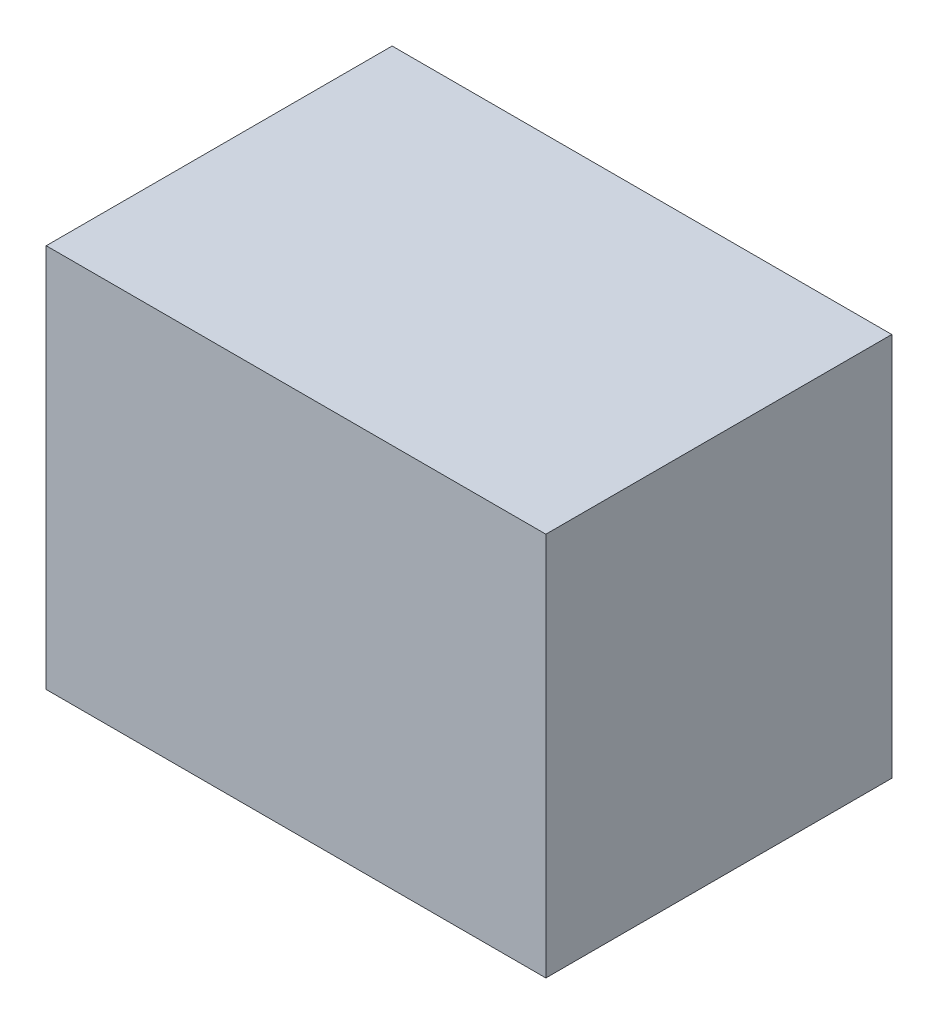
ISO-10303-21;
HEADER;
FILE_DESCRIPTION(('STEP AP214'),'2;1');
FILE_NAME('part.step','',(''),(''),'','','');
FILE_SCHEMA(('AUTOMOTIVE_DESIGN { 1 0 10303 214 1 1 1 1 }'));
ENDSEC;
DATA;
#1=APPLICATION_CONTEXT('core data for automotive mechanical design processes');
#2=APPLICATION_PROTOCOL_DEFINITION('international standard','automotive_design',2000,#1);
#3=PRODUCT_CONTEXT('',#1,'mechanical');
#4=PRODUCT('Part','Part','',(#3));
#5=PRODUCT_RELATED_PRODUCT_CATEGORY('part','',(#4));
#6=PRODUCT_DEFINITION_FORMATION('','',#4);
#7=PRODUCT_DEFINITION_CONTEXT('part definition',#1,'design');
#8=PRODUCT_DEFINITION('design','',#6,#7);
#9=PRODUCT_DEFINITION_SHAPE('','',#8);
#10=(LENGTH_UNIT() NAMED_UNIT(*) SI_UNIT(.MILLI.,.METRE.));
#11=(NAMED_UNIT(*) PLANE_ANGLE_UNIT() SI_UNIT($,.RADIAN.));
#12=(NAMED_UNIT(*) SI_UNIT($,.STERADIAN.) SOLID_ANGLE_UNIT());
#13=UNCERTAINTY_MEASURE_WITH_UNIT(LENGTH_MEASURE(1.E-05),#10,'distance_accuracy_value','');
#14=(GEOMETRIC_REPRESENTATION_CONTEXT(3) GLOBAL_UNCERTAINTY_ASSIGNED_CONTEXT((#13)) GLOBAL_UNIT_ASSIGNED_CONTEXT((#10,
#11,#12)) REPRESENTATION_CONTEXT('',''));
#15=CARTESIAN_POINT('',(0.,0.,0.));
#16=DIRECTION('',(0.,0.,1.));
#17=DIRECTION('',(1.,0.,0.));
#18=AXIS2_PLACEMENT_3D('',#15,#16,#17);
#19=CARTESIAN_POINT('',(65.,100.,-45.));
#20=DIRECTION('',(-1.,0.,0.));
#21=DIRECTION('',(0.,0.,1.));
#22=AXIS2_PLACEMENT_3D('',#19,#20,#21);
#23=PLANE('',#22);
#24=DIRECTION('',(0.,0.,-1.));
#25=VECTOR('',#24,1.);
#26=CARTESIAN_POINT('',(65.,0.,-45.));
#27=LINE('',#26,#25);
#28=CARTESIAN_POINT('',(65.,0.,45.));
#29=VERTEX_POINT('',#28);
#30=CARTESIAN_POINT('',(65.,0.,-45.));
#31=VERTEX_POINT('',#30);
#32=EDGE_CURVE('E100',#29,#31,#27,.T.);
#33=ORIENTED_EDGE('',*,*,#32,.T.);
#34=DIRECTION('',(0.,-1.,0.));
#35=VECTOR('',#34,1.);
#36=CARTESIAN_POINT('',(65.,100.,-45.));
#37=LINE('',#36,#35);
#38=CARTESIAN_POINT('',(65.,100.,-45.));
#39=VERTEX_POINT('',#38);
#40=EDGE_CURVE('E11',#39,#31,#37,.T.);
#41=ORIENTED_EDGE('',*,*,#40,.F.);
#42=DIRECTION('',(0.,0.,-1.));
#43=VECTOR('',#42,1.);
#44=CARTESIAN_POINT('',(65.,100.,-45.));
#45=LINE('',#44,#43);
#46=CARTESIAN_POINT('',(65.,100.,45.));
#47=VERTEX_POINT('',#46);
#48=EDGE_CURVE('E88',#47,#39,#45,.T.);
#49=ORIENTED_EDGE('',*,*,#48,.F.);
#50=DIRECTION('',(0.,-1.,0.));
#51=VECTOR('',#50,1.);
#52=CARTESIAN_POINT('',(65.,100.,45.));
#53=LINE('',#52,#51);
#54=EDGE_CURVE('E96',#47,#29,#53,.T.);
#55=ORIENTED_EDGE('',*,*,#54,.T.);
#56=EDGE_LOOP('',(#33,#41,#49,#55));
#57=FACE_BOUND('',#56,.T.);
#58=ADVANCED_FACE('F37',(#57),#23,.F.);
#59=CARTESIAN_POINT('',(-65.,100.,-45.));
#60=DIRECTION('',(0.,0.,1.));
#61=DIRECTION('',(1.,0.,0.));
#62=AXIS2_PLACEMENT_3D('',#59,#60,#61);
#63=PLANE('',#62);
#64=DIRECTION('',(-1.,0.,0.));
#65=VECTOR('',#64,1.);
#66=CARTESIAN_POINT('',(-65.,0.,-45.));
#67=LINE('',#66,#65);
#68=CARTESIAN_POINT('',(-65.,0.,-45.));
#69=VERTEX_POINT('',#68);
#70=EDGE_CURVE('E92',#31,#69,#67,.T.);
#71=ORIENTED_EDGE('',*,*,#70,.T.);
#72=DIRECTION('',(0.,-1.,0.));
#73=VECTOR('',#72,1.);
#74=CARTESIAN_POINT('',(-65.,100.,-45.));
#75=LINE('',#74,#73);
#76=CARTESIAN_POINT('',(-65.,100.,-45.));
#77=VERTEX_POINT('',#76);
#78=EDGE_CURVE('E45',#77,#69,#75,.T.);
#79=ORIENTED_EDGE('',*,*,#78,.F.);
#80=DIRECTION('',(-1.,0.,0.));
#81=VECTOR('',#80,1.);
#82=CARTESIAN_POINT('',(-65.,100.,-45.));
#83=LINE('',#82,#81);
#84=EDGE_CURVE('E83',#39,#77,#83,.T.);
#85=ORIENTED_EDGE('',*,*,#84,.F.);
#86=ORIENTED_EDGE('',*,*,#40,.T.);
#87=EDGE_LOOP('',(#71,#79,#85,#86));
#88=FACE_BOUND('',#87,.T.);
#89=ADVANCED_FACE('F91',(#88),#63,.F.);
#90=CARTESIAN_POINT('',(-65.,100.,-45.));
#91=DIRECTION('',(1.,0.,0.));
#92=DIRECTION('',(0.,0.,-1.));
#93=AXIS2_PLACEMENT_3D('',#90,#91,#92);
#94=PLANE('',#93);
#95=DIRECTION('',(0.,0.,1.));
#96=VECTOR('',#95,1.);
#97=CARTESIAN_POINT('',(-65.,0.,-45.));
#98=LINE('',#97,#96);
#99=CARTESIAN_POINT('',(-65.,0.,45.));
#100=VERTEX_POINT('',#99);
#101=EDGE_CURVE('E70',#69,#100,#98,.T.);
#102=ORIENTED_EDGE('',*,*,#101,.T.);
#103=DIRECTION('',(0.,-1.,0.));
#104=VECTOR('',#103,1.);
#105=CARTESIAN_POINT('',(-65.,100.,45.));
#106=LINE('',#105,#104);
#107=CARTESIAN_POINT('',(-65.,100.,45.));
#108=VERTEX_POINT('',#107);
#109=EDGE_CURVE('E93',#108,#100,#106,.T.);
#110=ORIENTED_EDGE('',*,*,#109,.F.);
#111=DIRECTION('',(0.,0.,1.));
#112=VECTOR('',#111,1.);
#113=CARTESIAN_POINT('',(-65.,100.,-45.));
#114=LINE('',#113,#112);
#115=EDGE_CURVE('E86',#77,#108,#114,.T.);
#116=ORIENTED_EDGE('',*,*,#115,.F.);
#117=ORIENTED_EDGE('',*,*,#78,.T.);
#118=EDGE_LOOP('',(#102,#110,#116,#117));
#119=FACE_BOUND('',#118,.T.);
#120=ADVANCED_FACE('F94',(#119),#94,.F.);
#121=CARTESIAN_POINT('',(-65.,100.,45.));
#122=DIRECTION('',(0.,0.,-1.));
#123=DIRECTION('',(-1.,0.,0.));
#124=AXIS2_PLACEMENT_3D('',#121,#122,#123);
#125=PLANE('',#124);
#126=DIRECTION('',(1.,0.,0.));
#127=VECTOR('',#126,1.);
#128=CARTESIAN_POINT('',(-65.,0.,45.));
#129=LINE('',#128,#127);
#130=EDGE_CURVE('E76',#100,#29,#129,.T.);
#131=ORIENTED_EDGE('',*,*,#130,.T.);
#132=ORIENTED_EDGE('',*,*,#54,.F.);
#133=DIRECTION('',(1.,0.,0.));
#134=VECTOR('',#133,1.);
#135=CARTESIAN_POINT('',(-65.,100.,45.));
#136=LINE('',#135,#134);
#137=EDGE_CURVE('E53',#108,#47,#136,.T.);
#138=ORIENTED_EDGE('',*,*,#137,.F.);
#139=ORIENTED_EDGE('',*,*,#109,.T.);
#140=EDGE_LOOP('',(#131,#132,#138,#139));
#141=FACE_BOUND('',#140,.T.);
#142=ADVANCED_FACE('F107',(#141),#125,.F.);
#143=CARTESIAN_POINT('',(0.,100.,0.));
#144=DIRECTION('',(0.,1.,0.));
#145=DIRECTION('',(0.,0.,1.));
#146=AXIS2_PLACEMENT_3D('',#143,#144,#145);
#147=PLANE('',#146);
#148=ORIENTED_EDGE('',*,*,#48,.T.);
#149=ORIENTED_EDGE('',*,*,#84,.T.);
#150=ORIENTED_EDGE('',*,*,#115,.T.);
#151=ORIENTED_EDGE('',*,*,#137,.T.);
#152=EDGE_LOOP('',(#148,#149,#150,#151));
#153=FACE_BOUND('',#152,.T.);
#154=ADVANCED_FACE('F84',(#153),#147,.T.);
#155=CARTESIAN_POINT('',(0.,0.,0.));
#156=DIRECTION('',(0.,1.,0.));
#157=DIRECTION('',(0.,0.,1.));
#158=AXIS2_PLACEMENT_3D('',#155,#156,#157);
#159=PLANE('',#158);
#160=ORIENTED_EDGE('',*,*,#32,.F.);
#161=ORIENTED_EDGE('',*,*,#130,.F.);
#162=ORIENTED_EDGE('',*,*,#101,.F.);
#163=ORIENTED_EDGE('',*,*,#70,.F.);
#164=EDGE_LOOP('',(#160,#161,#162,#163));
#165=FACE_BOUND('',#164,.T.);
#166=ADVANCED_FACE('F110',(#165),#159,.F.);
#167=CLOSED_SHELL('',(#58,#89,#120,#142,#154,#166));
#168=MANIFOLD_SOLID_BREP('B2',#167);
#169=ADVANCED_BREP_SHAPE_REPRESENTATION('',(#18,#168),#14);
#170=SHAPE_DEFINITION_REPRESENTATION(#9,#169);
ENDSEC;
END-ISO-10303-21;
